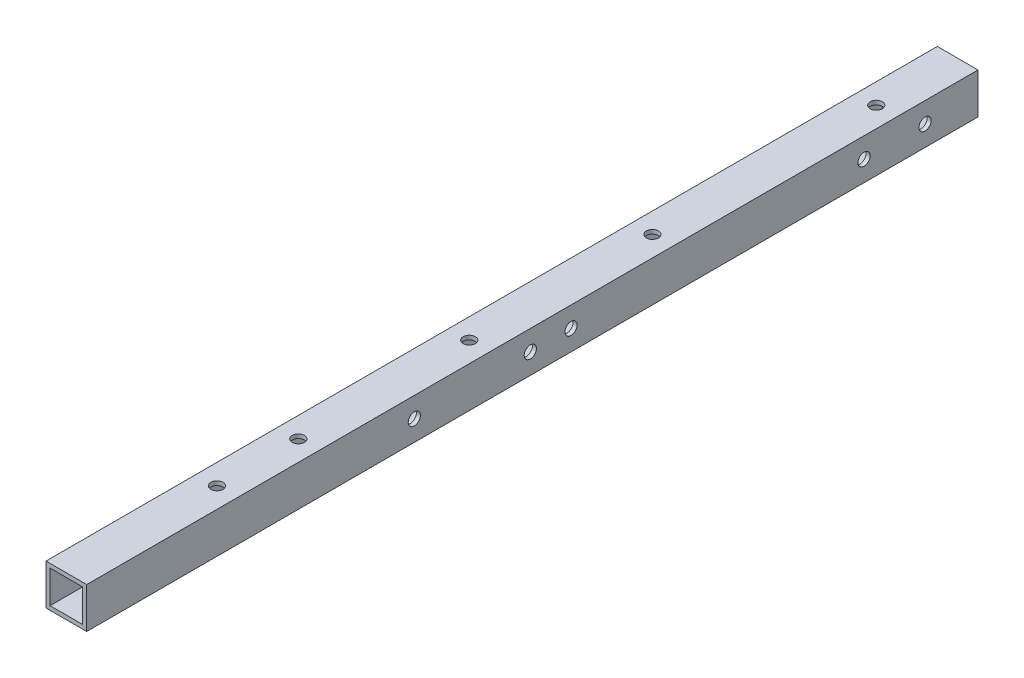
ISO-10303-21;
HEADER;
FILE_DESCRIPTION(('STEP AP214'),'2;1');
FILE_NAME('part.step','',(''),(''),'','','');
FILE_SCHEMA(('AUTOMOTIVE_DESIGN { 1 0 10303 214 1 1 1 1 }'));
ENDSEC;
DATA;
#1=APPLICATION_CONTEXT('core data for automotive mechanical design processes');
#2=APPLICATION_PROTOCOL_DEFINITION('international standard','automotive_design',2000,#1);
#3=PRODUCT_CONTEXT('',#1,'mechanical');
#4=PRODUCT('Part','Part','',(#3));
#5=PRODUCT_RELATED_PRODUCT_CATEGORY('part','',(#4));
#6=PRODUCT_DEFINITION_FORMATION('','',#4);
#7=PRODUCT_DEFINITION_CONTEXT('part definition',#1,'design');
#8=PRODUCT_DEFINITION('design','',#6,#7);
#9=PRODUCT_DEFINITION_SHAPE('','',#8);
#10=(LENGTH_UNIT() NAMED_UNIT(*) SI_UNIT(.MILLI.,.METRE.));
#11=(NAMED_UNIT(*) PLANE_ANGLE_UNIT() SI_UNIT($,.RADIAN.));
#12=(NAMED_UNIT(*) SI_UNIT($,.STERADIAN.) SOLID_ANGLE_UNIT());
#13=UNCERTAINTY_MEASURE_WITH_UNIT(LENGTH_MEASURE(1.E-05),#10,'distance_accuracy_value','');
#14=(GEOMETRIC_REPRESENTATION_CONTEXT(3) GLOBAL_UNCERTAINTY_ASSIGNED_CONTEXT((#13)) GLOBAL_UNIT_ASSIGNED_CONTEXT((#10,
#11,#12)) REPRESENTATION_CONTEXT('',''));
#15=CARTESIAN_POINT('',(0.,0.,0.));
#16=DIRECTION('',(0.,0.,1.));
#17=DIRECTION('',(1.,0.,0.));
#18=AXIS2_PLACEMENT_3D('',#15,#16,#17);
#19=CARTESIAN_POINT('',(0.,0.,219.));
#20=DIRECTION('',(0.,0.,1.));
#21=DIRECTION('',(1.,0.,0.));
#22=AXIS2_PLACEMENT_3D('',#19,#20,#21);
#23=PLANE('',#22);
#24=DIRECTION('',(0.,-1.,0.));
#25=VECTOR('',#24,1.);
#26=CARTESIAN_POINT('',(-5.,-5.,219.));
#27=LINE('',#26,#25);
#28=CARTESIAN_POINT('',(-5.,5.,219.));
#29=VERTEX_POINT('',#28);
#30=CARTESIAN_POINT('',(-5.,-5.,219.));
#31=VERTEX_POINT('',#30);
#32=EDGE_CURVE('E168',#29,#31,#27,.T.);
#33=ORIENTED_EDGE('',*,*,#32,.T.);
#34=DIRECTION('',(1.,0.,0.));
#35=VECTOR('',#34,1.);
#36=CARTESIAN_POINT('',(-5.,-5.,219.));
#37=LINE('',#36,#35);
#38=CARTESIAN_POINT('',(5.,-5.,219.));
#39=VERTEX_POINT('',#38);
#40=EDGE_CURVE('E171',#31,#39,#37,.T.);
#41=ORIENTED_EDGE('',*,*,#40,.T.);
#42=DIRECTION('',(0.,1.,0.));
#43=VECTOR('',#42,1.);
#44=CARTESIAN_POINT('',(5.,-5.,219.));
#45=LINE('',#44,#43);
#46=CARTESIAN_POINT('',(5.,5.,219.));
#47=VERTEX_POINT('',#46);
#48=EDGE_CURVE('E174',#39,#47,#45,.T.);
#49=ORIENTED_EDGE('',*,*,#48,.T.);
#50=DIRECTION('',(-1.,0.,0.));
#51=VECTOR('',#50,1.);
#52=CARTESIAN_POINT('',(-5.,5.,219.));
#53=LINE('',#52,#51);
#54=EDGE_CURVE('E176',#47,#29,#53,.T.);
#55=ORIENTED_EDGE('',*,*,#54,.T.);
#56=EDGE_LOOP('',(#33,#41,#49,#55));
#57=FACE_BOUND('',#56,.T.);
#58=DIRECTION('',(1.,0.,0.));
#59=VECTOR('',#58,1.);
#60=CARTESIAN_POINT('',(0.,-4.,219.));
#61=LINE('',#60,#59);
#62=CARTESIAN_POINT('',(-4.,-4.,219.));
#63=VERTEX_POINT('',#62);
#64=CARTESIAN_POINT('',(4.,-4.,219.));
#65=VERTEX_POINT('',#64);
#66=EDGE_CURVE('E138',#63,#65,#61,.T.);
#67=ORIENTED_EDGE('',*,*,#66,.F.);
#68=DIRECTION('',(0.,-1.,0.));
#69=VECTOR('',#68,1.);
#70=CARTESIAN_POINT('',(-4.,0.,219.));
#71=LINE('',#70,#69);
#72=CARTESIAN_POINT('',(-4.,4.,219.));
#73=VERTEX_POINT('',#72);
#74=EDGE_CURVE('E130',#73,#63,#71,.T.);
#75=ORIENTED_EDGE('',*,*,#74,.F.);
#76=DIRECTION('',(-1.,0.,0.));
#77=VECTOR('',#76,1.);
#78=CARTESIAN_POINT('',(0.,4.,219.));
#79=LINE('',#78,#77);
#80=CARTESIAN_POINT('',(4.,4.,219.));
#81=VERTEX_POINT('',#80);
#82=EDGE_CURVE('E152',#81,#73,#79,.T.);
#83=ORIENTED_EDGE('',*,*,#82,.F.);
#84=DIRECTION('',(0.,1.,0.));
#85=VECTOR('',#84,1.);
#86=CARTESIAN_POINT('',(4.,0.,219.));
#87=LINE('',#86,#85);
#88=EDGE_CURVE('E150',#65,#81,#87,.T.);
#89=ORIENTED_EDGE('',*,*,#88,.F.);
#90=EDGE_LOOP('',(#67,#75,#83,#89));
#91=FACE_BOUND('',#90,.T.);
#92=ADVANCED_FACE('F63',(#57,#91),#23,.T.);
#93=CARTESIAN_POINT('',(0.,0.,0.));
#94=DIRECTION('',(0.,0.,1.));
#95=DIRECTION('',(1.,0.,0.));
#96=AXIS2_PLACEMENT_3D('',#93,#94,#95);
#97=PLANE('',#96);
#98=DIRECTION('',(0.,-1.,0.));
#99=VECTOR('',#98,1.);
#100=CARTESIAN_POINT('',(-5.,-5.,0.));
#101=LINE('',#100,#99);
#102=CARTESIAN_POINT('',(-5.,5.,0.));
#103=VERTEX_POINT('',#102);
#104=CARTESIAN_POINT('',(-5.,-5.,0.));
#105=VERTEX_POINT('',#104);
#106=EDGE_CURVE('E146',#103,#105,#101,.T.);
#107=ORIENTED_EDGE('',*,*,#106,.F.);
#108=DIRECTION('',(-1.,0.,0.));
#109=VECTOR('',#108,1.);
#110=CARTESIAN_POINT('',(-5.,5.,0.));
#111=LINE('',#110,#109);
#112=CARTESIAN_POINT('',(5.,5.,0.));
#113=VERTEX_POINT('',#112);
#114=EDGE_CURVE('E172',#113,#103,#111,.T.);
#115=ORIENTED_EDGE('',*,*,#114,.F.);
#116=DIRECTION('',(0.,1.,0.));
#117=VECTOR('',#116,1.);
#118=CARTESIAN_POINT('',(5.,-5.,0.));
#119=LINE('',#118,#117);
#120=CARTESIAN_POINT('',(5.,-5.,0.));
#121=VERTEX_POINT('',#120);
#122=EDGE_CURVE('E183',#121,#113,#119,.T.);
#123=ORIENTED_EDGE('',*,*,#122,.F.);
#124=DIRECTION('',(1.,0.,0.));
#125=VECTOR('',#124,1.);
#126=CARTESIAN_POINT('',(-5.,-5.,0.));
#127=LINE('',#126,#125);
#128=EDGE_CURVE('E181',#105,#121,#127,.T.);
#129=ORIENTED_EDGE('',*,*,#128,.F.);
#130=EDGE_LOOP('',(#107,#115,#123,#129));
#131=FACE_BOUND('',#130,.T.);
#132=DIRECTION('',(0.,-1.,0.));
#133=VECTOR('',#132,1.);
#134=CARTESIAN_POINT('',(-4.,0.,0.));
#135=LINE('',#134,#133);
#136=CARTESIAN_POINT('',(-4.,4.,0.));
#137=VERTEX_POINT('',#136);
#138=CARTESIAN_POINT('',(-4.,-4.,0.));
#139=VERTEX_POINT('',#138);
#140=EDGE_CURVE('E88',#137,#139,#135,.T.);
#141=ORIENTED_EDGE('',*,*,#140,.T.);
#142=DIRECTION('',(1.,0.,0.));
#143=VECTOR('',#142,1.);
#144=CARTESIAN_POINT('',(0.,-4.,0.));
#145=LINE('',#144,#143);
#146=CARTESIAN_POINT('',(4.,-4.,0.));
#147=VERTEX_POINT('',#146);
#148=EDGE_CURVE('E145',#139,#147,#145,.T.);
#149=ORIENTED_EDGE('',*,*,#148,.T.);
#150=DIRECTION('',(0.,1.,0.));
#151=VECTOR('',#150,1.);
#152=CARTESIAN_POINT('',(4.,0.,0.));
#153=LINE('',#152,#151);
#154=CARTESIAN_POINT('',(4.,4.,0.));
#155=VERTEX_POINT('',#154);
#156=EDGE_CURVE('E160',#147,#155,#153,.T.);
#157=ORIENTED_EDGE('',*,*,#156,.T.);
#158=DIRECTION('',(-1.,0.,0.));
#159=VECTOR('',#158,1.);
#160=CARTESIAN_POINT('',(0.,4.,0.));
#161=LINE('',#160,#159);
#162=EDGE_CURVE('E139',#155,#137,#161,.T.);
#163=ORIENTED_EDGE('',*,*,#162,.T.);
#164=EDGE_LOOP('',(#141,#149,#157,#163));
#165=FACE_BOUND('',#164,.T.);
#166=ADVANCED_FACE('F319',(#131,#165),#97,.F.);
#167=CARTESIAN_POINT('',(-5.,-5.,219.));
#168=DIRECTION('',(1.,0.,0.));
#169=DIRECTION('',(0.,0.,-1.));
#170=AXIS2_PLACEMENT_3D('',#167,#168,#169);
#171=PLANE('',#170);
#172=CARTESIAN_POINT('',(-5.,0.,13.));
#173=DIRECTION('',(1.,0.,0.));
#174=DIRECTION('',(0.,0.,-1.));
#175=AXIS2_PLACEMENT_3D('',#172,#173,#174);
#176=CIRCLE('',#175,1.5);
#177=CARTESIAN_POINT('',(-5.,0.,11.5));
#178=VERTEX_POINT('',#177);
#179=EDGE_CURVE('E217',#178,#178,#176,.T.);
#180=ORIENTED_EDGE('',*,*,#179,.T.);
#181=EDGE_LOOP('',(#180));
#182=FACE_BOUND('',#181,.T.);
#183=CARTESIAN_POINT('',(-5.,0.,28.));
#184=DIRECTION('',(1.,0.,0.));
#185=DIRECTION('',(0.,0.,-1.));
#186=AXIS2_PLACEMENT_3D('',#183,#184,#185);
#187=CIRCLE('',#186,1.5);
#188=CARTESIAN_POINT('',(-5.,0.,26.5));
#189=VERTEX_POINT('',#188);
#190=EDGE_CURVE('E720',#189,#189,#187,.T.);
#191=ORIENTED_EDGE('',*,*,#190,.T.);
#192=EDGE_LOOP('',(#191));
#193=FACE_BOUND('',#192,.T.);
#194=CARTESIAN_POINT('',(-5.,0.,100.));
#195=DIRECTION('',(1.,0.,0.));
#196=DIRECTION('',(0.,0.,-1.));
#197=AXIS2_PLACEMENT_3D('',#194,#195,#196);
#198=CIRCLE('',#197,1.5);
#199=CARTESIAN_POINT('',(-5.,0.,98.5));
#200=VERTEX_POINT('',#199);
#201=EDGE_CURVE('E724',#200,#200,#198,.T.);
#202=ORIENTED_EDGE('',*,*,#201,.T.);
#203=EDGE_LOOP('',(#202));
#204=FACE_BOUND('',#203,.T.);
#205=CARTESIAN_POINT('',(-5.,0.,138.5));
#206=DIRECTION('',(1.,0.,0.));
#207=DIRECTION('',(0.,0.,-1.));
#208=AXIS2_PLACEMENT_3D('',#205,#206,#207);
#209=CIRCLE('',#208,1.5);
#210=CARTESIAN_POINT('',(-5.,0.,137.));
#211=VERTEX_POINT('',#210);
#212=EDGE_CURVE('E363',#211,#211,#209,.T.);
#213=ORIENTED_EDGE('',*,*,#212,.T.);
#214=EDGE_LOOP('',(#213));
#215=FACE_BOUND('',#214,.T.);
#216=CARTESIAN_POINT('',(-5.,0.,110.));
#217=DIRECTION('',(1.,0.,0.));
#218=DIRECTION('',(0.,0.,-1.));
#219=AXIS2_PLACEMENT_3D('',#216,#217,#218);
#220=CIRCLE('',#219,1.5);
#221=CARTESIAN_POINT('',(-5.,0.,108.5));
#222=VERTEX_POINT('',#221);
#223=EDGE_CURVE('E364',#222,#222,#220,.T.);
#224=ORIENTED_EDGE('',*,*,#223,.T.);
#225=EDGE_LOOP('',(#224));
#226=FACE_BOUND('',#225,.T.);
#227=ORIENTED_EDGE('',*,*,#106,.T.);
#228=DIRECTION('',(0.,0.,-1.));
#229=VECTOR('',#228,1.);
#230=CARTESIAN_POINT('',(-5.,-5.,219.));
#231=LINE('',#230,#229);
#232=EDGE_CURVE('E12',#31,#105,#231,.T.);
#233=ORIENTED_EDGE('',*,*,#232,.F.);
#234=ORIENTED_EDGE('',*,*,#32,.F.);
#235=DIRECTION('',(0.,0.,-1.));
#236=VECTOR('',#235,1.);
#237=CARTESIAN_POINT('',(-5.,5.,219.));
#238=LINE('',#237,#236);
#239=EDGE_CURVE('E178',#29,#103,#238,.T.);
#240=ORIENTED_EDGE('',*,*,#239,.T.);
#241=EDGE_LOOP('',(#227,#233,#234,#240));
#242=FACE_BOUND('',#241,.T.);
#243=ADVANCED_FACE('F65',(#182,#193,#204,#215,#226,#242),#171,.F.);
#244=CARTESIAN_POINT('',(-5.,-5.,219.));
#245=DIRECTION('',(0.,1.,0.));
#246=DIRECTION('',(-1.,0.,0.));
#247=AXIS2_PLACEMENT_3D('',#244,#245,#246);
#248=PLANE('',#247);
#249=CARTESIAN_POINT('',(0.,-5.,182.));
#250=DIRECTION('',(0.,1.,0.));
#251=DIRECTION('',(0.,0.,1.));
#252=AXIS2_PLACEMENT_3D('',#249,#250,#251);
#253=CIRCLE('',#252,1.5);
#254=CARTESIAN_POINT('',(0.,-5.,183.5));
#255=VERTEX_POINT('',#254);
#256=EDGE_CURVE('E197',#255,#255,#253,.T.);
#257=ORIENTED_EDGE('',*,*,#256,.T.);
#258=EDGE_LOOP('',(#257));
#259=FACE_BOUND('',#258,.T.);
#260=CARTESIAN_POINT('',(0.,-5.,75.));
#261=DIRECTION('',(0.,1.,0.));
#262=DIRECTION('',(0.,0.,1.));
#263=AXIS2_PLACEMENT_3D('',#260,#261,#262);
#264=CIRCLE('',#263,1.5);
#265=CARTESIAN_POINT('',(0.,-5.,76.5));
#266=VERTEX_POINT('',#265);
#267=EDGE_CURVE('E242',#266,#266,#264,.T.);
#268=ORIENTED_EDGE('',*,*,#267,.T.);
#269=EDGE_LOOP('',(#268));
#270=FACE_BOUND('',#269,.T.);
#271=CARTESIAN_POINT('',(0.,-5.,162.));
#272=DIRECTION('',(0.,1.,0.));
#273=DIRECTION('',(0.,0.,1.));
#274=AXIS2_PLACEMENT_3D('',#271,#272,#273);
#275=CIRCLE('',#274,1.5);
#276=CARTESIAN_POINT('',(0.,-5.,163.5));
#277=VERTEX_POINT('',#276);
#278=EDGE_CURVE('E253',#277,#277,#275,.T.);
#279=ORIENTED_EDGE('',*,*,#278,.T.);
#280=EDGE_LOOP('',(#279));
#281=FACE_BOUND('',#280,.T.);
#282=CARTESIAN_POINT('',(0.,-5.,120.));
#283=DIRECTION('',(0.,1.,0.));
#284=DIRECTION('',(0.,0.,1.));
#285=AXIS2_PLACEMENT_3D('',#282,#283,#284);
#286=CIRCLE('',#285,1.5);
#287=CARTESIAN_POINT('',(0.,-5.,121.5));
#288=VERTEX_POINT('',#287);
#289=EDGE_CURVE('E252',#288,#288,#286,.T.);
#290=ORIENTED_EDGE('',*,*,#289,.T.);
#291=EDGE_LOOP('',(#290));
#292=FACE_BOUND('',#291,.T.);
#293=CARTESIAN_POINT('',(0.,-5.,20.));
#294=DIRECTION('',(0.,1.,0.));
#295=DIRECTION('',(0.,0.,1.));
#296=AXIS2_PLACEMENT_3D('',#293,#294,#295);
#297=CIRCLE('',#296,1.5);
#298=CARTESIAN_POINT('',(0.,-5.,21.5));
#299=VERTEX_POINT('',#298);
#300=EDGE_CURVE('E263',#299,#299,#297,.T.);
#301=ORIENTED_EDGE('',*,*,#300,.T.);
#302=EDGE_LOOP('',(#301));
#303=FACE_BOUND('',#302,.T.);
#304=ORIENTED_EDGE('',*,*,#128,.T.);
#305=DIRECTION('',(0.,0.,-1.));
#306=VECTOR('',#305,1.);
#307=CARTESIAN_POINT('',(5.,-5.,219.));
#308=LINE('',#307,#306);
#309=EDGE_CURVE('E72',#39,#121,#308,.T.);
#310=ORIENTED_EDGE('',*,*,#309,.F.);
#311=ORIENTED_EDGE('',*,*,#40,.F.);
#312=ORIENTED_EDGE('',*,*,#232,.T.);
#313=EDGE_LOOP('',(#304,#310,#311,#312));
#314=FACE_BOUND('',#313,.T.);
#315=ADVANCED_FACE('F305',(#259,#270,#281,#292,#303,#314),#248,.F.);
#316=CARTESIAN_POINT('',(5.,-5.,219.));
#317=DIRECTION('',(-1.,0.,0.));
#318=DIRECTION('',(0.,0.,1.));
#319=AXIS2_PLACEMENT_3D('',#316,#317,#318);
#320=PLANE('',#319);
#321=CARTESIAN_POINT('',(5.,0.,13.));
#322=DIRECTION('',(1.,0.,0.));
#323=DIRECTION('',(0.,0.,-1.));
#324=AXIS2_PLACEMENT_3D('',#321,#322,#323);
#325=CIRCLE('',#324,1.5);
#326=CARTESIAN_POINT('',(5.,0.,11.5));
#327=VERTEX_POINT('',#326);
#328=EDGE_CURVE('E346',#327,#327,#325,.T.);
#329=ORIENTED_EDGE('',*,*,#328,.F.);
#330=EDGE_LOOP('',(#329));
#331=FACE_BOUND('',#330,.T.);
#332=CARTESIAN_POINT('',(5.,0.,28.));
#333=DIRECTION('',(1.,0.,0.));
#334=DIRECTION('',(0.,0.,-1.));
#335=AXIS2_PLACEMENT_3D('',#332,#333,#334);
#336=CIRCLE('',#335,1.5);
#337=CARTESIAN_POINT('',(5.,0.,26.5));
#338=VERTEX_POINT('',#337);
#339=EDGE_CURVE('E350',#338,#338,#336,.T.);
#340=ORIENTED_EDGE('',*,*,#339,.F.);
#341=EDGE_LOOP('',(#340));
#342=FACE_BOUND('',#341,.T.);
#343=CARTESIAN_POINT('',(5.,0.,100.));
#344=DIRECTION('',(1.,0.,0.));
#345=DIRECTION('',(0.,0.,-1.));
#346=AXIS2_PLACEMENT_3D('',#343,#344,#345);
#347=CIRCLE('',#346,1.5);
#348=CARTESIAN_POINT('',(5.,0.,98.5));
#349=VERTEX_POINT('',#348);
#350=EDGE_CURVE('E354',#349,#349,#347,.T.);
#351=ORIENTED_EDGE('',*,*,#350,.F.);
#352=EDGE_LOOP('',(#351));
#353=FACE_BOUND('',#352,.T.);
#354=CARTESIAN_POINT('',(5.,0.,138.5));
#355=DIRECTION('',(1.,0.,0.));
#356=DIRECTION('',(0.,0.,-1.));
#357=AXIS2_PLACEMENT_3D('',#354,#355,#356);
#358=CIRCLE('',#357,1.5);
#359=CARTESIAN_POINT('',(5.,0.,137.));
#360=VERTEX_POINT('',#359);
#361=EDGE_CURVE('E358',#360,#360,#358,.T.);
#362=ORIENTED_EDGE('',*,*,#361,.F.);
#363=EDGE_LOOP('',(#362));
#364=FACE_BOUND('',#363,.T.);
#365=CARTESIAN_POINT('',(5.,0.,110.));
#366=DIRECTION('',(1.,0.,0.));
#367=DIRECTION('',(0.,0.,-1.));
#368=AXIS2_PLACEMENT_3D('',#365,#366,#367);
#369=CIRCLE('',#368,1.5);
#370=CARTESIAN_POINT('',(5.,0.,108.5));
#371=VERTEX_POINT('',#370);
#372=EDGE_CURVE('E361',#371,#371,#369,.T.);
#373=ORIENTED_EDGE('',*,*,#372,.F.);
#374=EDGE_LOOP('',(#373));
#375=FACE_BOUND('',#374,.T.);
#376=ORIENTED_EDGE('',*,*,#122,.T.);
#377=DIRECTION('',(0.,0.,-1.));
#378=VECTOR('',#377,1.);
#379=CARTESIAN_POINT('',(5.,5.,219.));
#380=LINE('',#379,#378);
#381=EDGE_CURVE('E188',#47,#113,#380,.T.);
#382=ORIENTED_EDGE('',*,*,#381,.F.);
#383=ORIENTED_EDGE('',*,*,#48,.F.);
#384=ORIENTED_EDGE('',*,*,#309,.T.);
#385=EDGE_LOOP('',(#376,#382,#383,#384));
#386=FACE_BOUND('',#385,.T.);
#387=ADVANCED_FACE('F308',(#331,#342,#353,#364,#375,#386),#320,.F.);
#388=CARTESIAN_POINT('',(-5.,5.,219.));
#389=DIRECTION('',(0.,-1.,0.));
#390=DIRECTION('',(0.,0.,-1.));
#391=AXIS2_PLACEMENT_3D('',#388,#389,#390);
#392=PLANE('',#391);
#393=CARTESIAN_POINT('',(0.,5.,182.));
#394=DIRECTION('',(0.,1.,0.));
#395=DIRECTION('',(0.,0.,1.));
#396=AXIS2_PLACEMENT_3D('',#393,#394,#395);
#397=CIRCLE('',#396,1.5);
#398=CARTESIAN_POINT('',(0.,5.,183.5));
#399=VERTEX_POINT('',#398);
#400=EDGE_CURVE('E245',#399,#399,#397,.T.);
#401=ORIENTED_EDGE('',*,*,#400,.F.);
#402=EDGE_LOOP('',(#401));
#403=FACE_BOUND('',#402,.T.);
#404=CARTESIAN_POINT('',(0.,5.,75.));
#405=DIRECTION('',(0.,1.,0.));
#406=DIRECTION('',(0.,0.,1.));
#407=AXIS2_PLACEMENT_3D('',#404,#405,#406);
#408=CIRCLE('',#407,1.5);
#409=CARTESIAN_POINT('',(0.,5.,76.5));
#410=VERTEX_POINT('',#409);
#411=EDGE_CURVE('E256',#410,#410,#408,.T.);
#412=ORIENTED_EDGE('',*,*,#411,.F.);
#413=EDGE_LOOP('',(#412));
#414=FACE_BOUND('',#413,.T.);
#415=CARTESIAN_POINT('',(0.,5.,162.));
#416=DIRECTION('',(0.,1.,0.));
#417=DIRECTION('',(0.,0.,1.));
#418=AXIS2_PLACEMENT_3D('',#415,#416,#417);
#419=CIRCLE('',#418,1.5);
#420=CARTESIAN_POINT('',(0.,5.,163.5));
#421=VERTEX_POINT('',#420);
#422=EDGE_CURVE('E249',#421,#421,#419,.T.);
#423=ORIENTED_EDGE('',*,*,#422,.F.);
#424=EDGE_LOOP('',(#423));
#425=FACE_BOUND('',#424,.T.);
#426=CARTESIAN_POINT('',(0.,5.,120.));
#427=DIRECTION('',(0.,1.,0.));
#428=DIRECTION('',(0.,0.,1.));
#429=AXIS2_PLACEMENT_3D('',#426,#427,#428);
#430=CIRCLE('',#429,1.5);
#431=CARTESIAN_POINT('',(0.,5.,121.5));
#432=VERTEX_POINT('',#431);
#433=EDGE_CURVE('E266',#432,#432,#430,.T.);
#434=ORIENTED_EDGE('',*,*,#433,.F.);
#435=EDGE_LOOP('',(#434));
#436=FACE_BOUND('',#435,.T.);
#437=CARTESIAN_POINT('',(0.,5.,20.));
#438=DIRECTION('',(0.,1.,0.));
#439=DIRECTION('',(0.,0.,1.));
#440=AXIS2_PLACEMENT_3D('',#437,#438,#439);
#441=CIRCLE('',#440,1.5);
#442=CARTESIAN_POINT('',(0.,5.,21.5));
#443=VERTEX_POINT('',#442);
#444=EDGE_CURVE('E248',#443,#443,#441,.T.);
#445=ORIENTED_EDGE('',*,*,#444,.F.);
#446=EDGE_LOOP('',(#445));
#447=FACE_BOUND('',#446,.T.);
#448=ORIENTED_EDGE('',*,*,#114,.T.);
#449=ORIENTED_EDGE('',*,*,#239,.F.);
#450=ORIENTED_EDGE('',*,*,#54,.F.);
#451=ORIENTED_EDGE('',*,*,#381,.T.);
#452=EDGE_LOOP('',(#448,#449,#450,#451));
#453=FACE_BOUND('',#452,.T.);
#454=ADVANCED_FACE('F323',(#403,#414,#425,#436,#447,#453),#392,.F.);
#455=CARTESIAN_POINT('',(-4.,0.,219.));
#456=DIRECTION('',(1.,0.,0.));
#457=DIRECTION('',(0.,0.,-1.));
#458=AXIS2_PLACEMENT_3D('',#455,#456,#457);
#459=PLANE('',#458);
#460=CARTESIAN_POINT('',(-4.,0.,13.));
#461=DIRECTION('',(1.,0.,0.));
#462=DIRECTION('',(0.,0.,-1.));
#463=AXIS2_PLACEMENT_3D('',#460,#461,#462);
#464=CIRCLE('',#463,1.5);
#465=CARTESIAN_POINT('',(-4.,0.,11.5));
#466=VERTEX_POINT('',#465);
#467=EDGE_CURVE('E239',#466,#466,#464,.T.);
#468=ORIENTED_EDGE('',*,*,#467,.F.);
#469=EDGE_LOOP('',(#468));
#470=FACE_BOUND('',#469,.T.);
#471=CARTESIAN_POINT('',(-4.,0.,28.));
#472=DIRECTION('',(1.,0.,0.));
#473=DIRECTION('',(0.,0.,-1.));
#474=AXIS2_PLACEMENT_3D('',#471,#472,#473);
#475=CIRCLE('',#474,1.5);
#476=CARTESIAN_POINT('',(-4.,0.,26.5));
#477=VERTEX_POINT('',#476);
#478=EDGE_CURVE('E227',#477,#477,#475,.T.);
#479=ORIENTED_EDGE('',*,*,#478,.F.);
#480=EDGE_LOOP('',(#479));
#481=FACE_BOUND('',#480,.T.);
#482=CARTESIAN_POINT('',(-4.,0.,100.));
#483=DIRECTION('',(1.,0.,0.));
#484=DIRECTION('',(0.,0.,-1.));
#485=AXIS2_PLACEMENT_3D('',#482,#483,#484);
#486=CIRCLE('',#485,1.5);
#487=CARTESIAN_POINT('',(-4.,0.,98.5));
#488=VERTEX_POINT('',#487);
#489=EDGE_CURVE('E224',#488,#488,#486,.T.);
#490=ORIENTED_EDGE('',*,*,#489,.F.);
#491=EDGE_LOOP('',(#490));
#492=FACE_BOUND('',#491,.T.);
#493=CARTESIAN_POINT('',(-4.,0.,138.5));
#494=DIRECTION('',(1.,0.,0.));
#495=DIRECTION('',(0.,0.,-1.));
#496=AXIS2_PLACEMENT_3D('',#493,#494,#495);
#497=CIRCLE('',#496,1.5);
#498=CARTESIAN_POINT('',(-4.,0.,137.));
#499=VERTEX_POINT('',#498);
#500=EDGE_CURVE('E221',#499,#499,#497,.T.);
#501=ORIENTED_EDGE('',*,*,#500,.F.);
#502=EDGE_LOOP('',(#501));
#503=FACE_BOUND('',#502,.T.);
#504=CARTESIAN_POINT('',(-4.,0.,110.));
#505=DIRECTION('',(1.,0.,0.));
#506=DIRECTION('',(0.,0.,-1.));
#507=AXIS2_PLACEMENT_3D('',#504,#505,#506);
#508=CIRCLE('',#507,1.5);
#509=CARTESIAN_POINT('',(-4.,0.,108.5));
#510=VERTEX_POINT('',#509);
#511=EDGE_CURVE('E216',#510,#510,#508,.T.);
#512=ORIENTED_EDGE('',*,*,#511,.F.);
#513=EDGE_LOOP('',(#512));
#514=FACE_BOUND('',#513,.T.);
#515=ORIENTED_EDGE('',*,*,#140,.F.);
#516=DIRECTION('',(0.,0.,-1.));
#517=VECTOR('',#516,1.);
#518=CARTESIAN_POINT('',(-4.,4.,219.));
#519=LINE('',#518,#517);
#520=EDGE_CURVE('E134',#73,#137,#519,.T.);
#521=ORIENTED_EDGE('',*,*,#520,.F.);
#522=ORIENTED_EDGE('',*,*,#74,.T.);
#523=DIRECTION('',(0.,0.,-1.));
#524=VECTOR('',#523,1.);
#525=CARTESIAN_POINT('',(-4.,-4.,219.));
#526=LINE('',#525,#524);
#527=EDGE_CURVE('E133',#63,#139,#526,.T.);
#528=ORIENTED_EDGE('',*,*,#527,.T.);
#529=EDGE_LOOP('',(#515,#521,#522,#528));
#530=FACE_BOUND('',#529,.T.);
#531=ADVANCED_FACE('F132',(#470,#481,#492,#503,#514,#530),#459,.T.);
#532=CARTESIAN_POINT('',(0.,-4.,219.));
#533=DIRECTION('',(0.,1.,0.));
#534=DIRECTION('',(-1.,0.,0.));
#535=AXIS2_PLACEMENT_3D('',#532,#533,#534);
#536=PLANE('',#535);
#537=CARTESIAN_POINT('',(0.,-4.,182.));
#538=DIRECTION('',(0.,1.,0.));
#539=DIRECTION('',(-1.,0.,0.));
#540=AXIS2_PLACEMENT_3D('',#537,#538,#539);
#541=CIRCLE('',#540,1.5);
#542=CARTESIAN_POINT('',(-1.5,-4.,182.));
#543=VERTEX_POINT('',#542);
#544=EDGE_CURVE('E158',#543,#543,#541,.T.);
#545=ORIENTED_EDGE('',*,*,#544,.F.);
#546=EDGE_LOOP('',(#545));
#547=FACE_BOUND('',#546,.T.);
#548=CARTESIAN_POINT('',(0.,-4.,75.));
#549=DIRECTION('',(0.,1.,0.));
#550=DIRECTION('',(-1.,0.,0.));
#551=AXIS2_PLACEMENT_3D('',#548,#549,#550);
#552=CIRCLE('',#551,1.5);
#553=CARTESIAN_POINT('',(-1.5,-4.,75.));
#554=VERTEX_POINT('',#553);
#555=EDGE_CURVE('E209',#554,#554,#552,.T.);
#556=ORIENTED_EDGE('',*,*,#555,.F.);
#557=EDGE_LOOP('',(#556));
#558=FACE_BOUND('',#557,.T.);
#559=CARTESIAN_POINT('',(0.,-4.,162.));
#560=DIRECTION('',(0.,1.,0.));
#561=DIRECTION('',(-1.,0.,0.));
#562=AXIS2_PLACEMENT_3D('',#559,#560,#561);
#563=CIRCLE('',#562,1.5);
#564=CARTESIAN_POINT('',(-1.5,-4.,162.));
#565=VERTEX_POINT('',#564);
#566=EDGE_CURVE('E205',#565,#565,#563,.T.);
#567=ORIENTED_EDGE('',*,*,#566,.F.);
#568=EDGE_LOOP('',(#567));
#569=FACE_BOUND('',#568,.T.);
#570=CARTESIAN_POINT('',(0.,-4.,120.));
#571=DIRECTION('',(0.,1.,0.));
#572=DIRECTION('',(-1.,0.,0.));
#573=AXIS2_PLACEMENT_3D('',#570,#571,#572);
#574=CIRCLE('',#573,1.5);
#575=CARTESIAN_POINT('',(-1.5,-4.,120.));
#576=VERTEX_POINT('',#575);
#577=EDGE_CURVE('E201',#576,#576,#574,.T.);
#578=ORIENTED_EDGE('',*,*,#577,.F.);
#579=EDGE_LOOP('',(#578));
#580=FACE_BOUND('',#579,.T.);
#581=CARTESIAN_POINT('',(0.,-4.,20.));
#582=DIRECTION('',(0.,1.,0.));
#583=DIRECTION('',(-1.,0.,0.));
#584=AXIS2_PLACEMENT_3D('',#581,#582,#583);
#585=CIRCLE('',#584,1.5);
#586=CARTESIAN_POINT('',(-1.5,-4.,20.));
#587=VERTEX_POINT('',#586);
#588=EDGE_CURVE('E196',#587,#587,#585,.T.);
#589=ORIENTED_EDGE('',*,*,#588,.F.);
#590=EDGE_LOOP('',(#589));
#591=FACE_BOUND('',#590,.T.);
#592=ORIENTED_EDGE('',*,*,#148,.F.);
#593=ORIENTED_EDGE('',*,*,#527,.F.);
#594=ORIENTED_EDGE('',*,*,#66,.T.);
#595=DIRECTION('',(0.,0.,-1.));
#596=VECTOR('',#595,1.);
#597=CARTESIAN_POINT('',(4.,-4.,219.));
#598=LINE('',#597,#596);
#599=EDGE_CURVE('E147',#65,#147,#598,.T.);
#600=ORIENTED_EDGE('',*,*,#599,.T.);
#601=EDGE_LOOP('',(#592,#593,#594,#600));
#602=FACE_BOUND('',#601,.T.);
#603=ADVANCED_FACE('F142',(#547,#558,#569,#580,#591,#602),#536,.T.);
#604=CARTESIAN_POINT('',(4.,0.,219.));
#605=DIRECTION('',(-1.,0.,0.));
#606=DIRECTION('',(0.,0.,1.));
#607=AXIS2_PLACEMENT_3D('',#604,#605,#606);
#608=PLANE('',#607);
#609=CARTESIAN_POINT('',(4.,0.,13.));
#610=DIRECTION('',(-1.,0.,0.));
#611=DIRECTION('',(0.,0.,1.));
#612=AXIS2_PLACEMENT_3D('',#609,#610,#611);
#613=CIRCLE('',#612,1.5);
#614=CARTESIAN_POINT('',(4.,0.,14.5));
#615=VERTEX_POINT('',#614);
#616=EDGE_CURVE('E67',#615,#615,#613,.T.);
#617=ORIENTED_EDGE('',*,*,#616,.F.);
#618=EDGE_LOOP('',(#617));
#619=FACE_BOUND('',#618,.T.);
#620=CARTESIAN_POINT('',(4.,0.,28.));
#621=DIRECTION('',(-1.,0.,0.));
#622=DIRECTION('',(0.,0.,1.));
#623=AXIS2_PLACEMENT_3D('',#620,#621,#622);
#624=CIRCLE('',#623,1.5);
#625=CARTESIAN_POINT('',(4.,0.,29.5));
#626=VERTEX_POINT('',#625);
#627=EDGE_CURVE('E225',#626,#626,#624,.T.);
#628=ORIENTED_EDGE('',*,*,#627,.F.);
#629=EDGE_LOOP('',(#628));
#630=FACE_BOUND('',#629,.T.);
#631=CARTESIAN_POINT('',(4.,0.,100.));
#632=DIRECTION('',(-1.,0.,0.));
#633=DIRECTION('',(0.,0.,1.));
#634=AXIS2_PLACEMENT_3D('',#631,#632,#633);
#635=CIRCLE('',#634,1.5);
#636=CARTESIAN_POINT('',(4.,0.,101.5));
#637=VERTEX_POINT('',#636);
#638=EDGE_CURVE('E222',#637,#637,#635,.T.);
#639=ORIENTED_EDGE('',*,*,#638,.F.);
#640=EDGE_LOOP('',(#639));
#641=FACE_BOUND('',#640,.T.);
#642=CARTESIAN_POINT('',(4.,0.,138.5));
#643=DIRECTION('',(-1.,0.,0.));
#644=DIRECTION('',(0.,0.,1.));
#645=AXIS2_PLACEMENT_3D('',#642,#643,#644);
#646=CIRCLE('',#645,1.5);
#647=CARTESIAN_POINT('',(4.,0.,140.));
#648=VERTEX_POINT('',#647);
#649=EDGE_CURVE('E218',#648,#648,#646,.T.);
#650=ORIENTED_EDGE('',*,*,#649,.F.);
#651=EDGE_LOOP('',(#650));
#652=FACE_BOUND('',#651,.T.);
#653=CARTESIAN_POINT('',(4.,0.,110.));
#654=DIRECTION('',(-1.,0.,0.));
#655=DIRECTION('',(0.,0.,1.));
#656=AXIS2_PLACEMENT_3D('',#653,#654,#655);
#657=CIRCLE('',#656,1.5);
#658=CARTESIAN_POINT('',(4.,0.,111.5));
#659=VERTEX_POINT('',#658);
#660=EDGE_CURVE('E213',#659,#659,#657,.T.);
#661=ORIENTED_EDGE('',*,*,#660,.F.);
#662=EDGE_LOOP('',(#661));
#663=FACE_BOUND('',#662,.T.);
#664=ORIENTED_EDGE('',*,*,#156,.F.);
#665=ORIENTED_EDGE('',*,*,#599,.F.);
#666=ORIENTED_EDGE('',*,*,#88,.T.);
#667=DIRECTION('',(0.,0.,-1.));
#668=VECTOR('',#667,1.);
#669=CARTESIAN_POINT('',(4.,4.,219.));
#670=LINE('',#669,#668);
#671=EDGE_CURVE('E80',#81,#155,#670,.T.);
#672=ORIENTED_EDGE('',*,*,#671,.T.);
#673=EDGE_LOOP('',(#664,#665,#666,#672));
#674=FACE_BOUND('',#673,.T.);
#675=ADVANCED_FACE('F286',(#619,#630,#641,#652,#663,#674),#608,.T.);
#676=CARTESIAN_POINT('',(0.,4.,219.));
#677=DIRECTION('',(0.,-1.,0.));
#678=DIRECTION('',(0.,0.,-1.));
#679=AXIS2_PLACEMENT_3D('',#676,#677,#678);
#680=PLANE('',#679);
#681=CARTESIAN_POINT('',(0.,4.,182.));
#682=DIRECTION('',(0.,-1.,0.));
#683=DIRECTION('',(0.,0.,-1.));
#684=AXIS2_PLACEMENT_3D('',#681,#682,#683);
#685=CIRCLE('',#684,1.5);
#686=CARTESIAN_POINT('',(0.,4.,180.5));
#687=VERTEX_POINT('',#686);
#688=EDGE_CURVE('E210',#687,#687,#685,.T.);
#689=ORIENTED_EDGE('',*,*,#688,.F.);
#690=EDGE_LOOP('',(#689));
#691=FACE_BOUND('',#690,.T.);
#692=CARTESIAN_POINT('',(0.,4.,75.));
#693=DIRECTION('',(0.,-1.,0.));
#694=DIRECTION('',(0.,0.,-1.));
#695=AXIS2_PLACEMENT_3D('',#692,#693,#694);
#696=CIRCLE('',#695,1.5);
#697=CARTESIAN_POINT('',(0.,4.,73.5));
#698=VERTEX_POINT('',#697);
#699=EDGE_CURVE('E206',#698,#698,#696,.T.);
#700=ORIENTED_EDGE('',*,*,#699,.F.);
#701=EDGE_LOOP('',(#700));
#702=FACE_BOUND('',#701,.T.);
#703=CARTESIAN_POINT('',(0.,4.,162.));
#704=DIRECTION('',(0.,-1.,0.));
#705=DIRECTION('',(0.,0.,-1.));
#706=AXIS2_PLACEMENT_3D('',#703,#704,#705);
#707=CIRCLE('',#706,1.5);
#708=CARTESIAN_POINT('',(0.,4.,160.5));
#709=VERTEX_POINT('',#708);
#710=EDGE_CURVE('E202',#709,#709,#707,.T.);
#711=ORIENTED_EDGE('',*,*,#710,.F.);
#712=EDGE_LOOP('',(#711));
#713=FACE_BOUND('',#712,.T.);
#714=CARTESIAN_POINT('',(0.,4.,120.));
#715=DIRECTION('',(0.,-1.,0.));
#716=DIRECTION('',(0.,0.,-1.));
#717=AXIS2_PLACEMENT_3D('',#714,#715,#716);
#718=CIRCLE('',#717,1.5);
#719=CARTESIAN_POINT('',(0.,4.,118.5));
#720=VERTEX_POINT('',#719);
#721=EDGE_CURVE('E198',#720,#720,#718,.T.);
#722=ORIENTED_EDGE('',*,*,#721,.F.);
#723=EDGE_LOOP('',(#722));
#724=FACE_BOUND('',#723,.T.);
#725=CARTESIAN_POINT('',(0.,4.,20.));
#726=DIRECTION('',(0.,-1.,0.));
#727=DIRECTION('',(0.,0.,-1.));
#728=AXIS2_PLACEMENT_3D('',#725,#726,#727);
#729=CIRCLE('',#728,1.5);
#730=CARTESIAN_POINT('',(0.,4.,18.5));
#731=VERTEX_POINT('',#730);
#732=EDGE_CURVE('E193',#731,#731,#729,.T.);
#733=ORIENTED_EDGE('',*,*,#732,.F.);
#734=EDGE_LOOP('',(#733));
#735=FACE_BOUND('',#734,.T.);
#736=ORIENTED_EDGE('',*,*,#162,.F.);
#737=ORIENTED_EDGE('',*,*,#671,.F.);
#738=ORIENTED_EDGE('',*,*,#82,.T.);
#739=ORIENTED_EDGE('',*,*,#520,.T.);
#740=EDGE_LOOP('',(#736,#737,#738,#739));
#741=FACE_BOUND('',#740,.T.);
#742=ADVANCED_FACE('F426',(#691,#702,#713,#724,#735,#741),#680,.T.);
#743=CARTESIAN_POINT('',(0.,-5.,20.));
#744=DIRECTION('',(0.,1.,0.));
#745=DIRECTION('',(0.,0.,1.));
#746=AXIS2_PLACEMENT_3D('',#743,#744,#745);
#747=CYLINDRICAL_SURFACE('',#746,1.5);
#748=ORIENTED_EDGE('',*,*,#732,.T.);
#749=EDGE_LOOP('',(#748));
#750=FACE_BOUND('',#749,.T.);
#751=ORIENTED_EDGE('',*,*,#444,.T.);
#752=EDGE_LOOP('',(#751));
#753=FACE_BOUND('',#752,.T.);
#754=ADVANCED_FACE('F302',(#750,#753),#747,.F.);
#755=CARTESIAN_POINT('',(0.,-5.,120.));
#756=DIRECTION('',(0.,1.,0.));
#757=DIRECTION('',(0.,0.,1.));
#758=AXIS2_PLACEMENT_3D('',#755,#756,#757);
#759=CYLINDRICAL_SURFACE('',#758,1.5);
#760=ORIENTED_EDGE('',*,*,#721,.T.);
#761=EDGE_LOOP('',(#760));
#762=FACE_BOUND('',#761,.T.);
#763=ORIENTED_EDGE('',*,*,#433,.T.);
#764=EDGE_LOOP('',(#763));
#765=FACE_BOUND('',#764,.T.);
#766=ADVANCED_FACE('F436',(#762,#765),#759,.F.);
#767=CARTESIAN_POINT('',(0.,-5.,162.));
#768=DIRECTION('',(0.,1.,0.));
#769=DIRECTION('',(0.,0.,1.));
#770=AXIS2_PLACEMENT_3D('',#767,#768,#769);
#771=CYLINDRICAL_SURFACE('',#770,1.5);
#772=ORIENTED_EDGE('',*,*,#710,.T.);
#773=EDGE_LOOP('',(#772));
#774=FACE_BOUND('',#773,.T.);
#775=ORIENTED_EDGE('',*,*,#422,.T.);
#776=EDGE_LOOP('',(#775));
#777=FACE_BOUND('',#776,.T.);
#778=ADVANCED_FACE('F442',(#774,#777),#771,.F.);
#779=CARTESIAN_POINT('',(0.,-5.,75.));
#780=DIRECTION('',(0.,1.,0.));
#781=DIRECTION('',(0.,0.,1.));
#782=AXIS2_PLACEMENT_3D('',#779,#780,#781);
#783=CYLINDRICAL_SURFACE('',#782,1.5);
#784=ORIENTED_EDGE('',*,*,#699,.T.);
#785=EDGE_LOOP('',(#784));
#786=FACE_BOUND('',#785,.T.);
#787=ORIENTED_EDGE('',*,*,#411,.T.);
#788=EDGE_LOOP('',(#787));
#789=FACE_BOUND('',#788,.T.);
#790=ADVANCED_FACE('F445',(#786,#789),#783,.F.);
#791=CARTESIAN_POINT('',(0.,-5.,182.));
#792=DIRECTION('',(0.,1.,0.));
#793=DIRECTION('',(0.,0.,1.));
#794=AXIS2_PLACEMENT_3D('',#791,#792,#793);
#795=CYLINDRICAL_SURFACE('',#794,1.5);
#796=ORIENTED_EDGE('',*,*,#688,.T.);
#797=EDGE_LOOP('',(#796));
#798=FACE_BOUND('',#797,.T.);
#799=ORIENTED_EDGE('',*,*,#400,.T.);
#800=EDGE_LOOP('',(#799));
#801=FACE_BOUND('',#800,.T.);
#802=ADVANCED_FACE('F300',(#798,#801),#795,.F.);
#803=ORIENTED_EDGE('',*,*,#588,.T.);
#804=EDGE_LOOP('',(#803));
#805=FACE_BOUND('',#804,.T.);
#806=ORIENTED_EDGE('',*,*,#300,.F.);
#807=EDGE_LOOP('',(#806));
#808=FACE_BOUND('',#807,.T.);
#809=ADVANCED_FACE('F296',(#805,#808),#747,.F.);
#810=ORIENTED_EDGE('',*,*,#577,.T.);
#811=EDGE_LOOP('',(#810));
#812=FACE_BOUND('',#811,.T.);
#813=ORIENTED_EDGE('',*,*,#289,.F.);
#814=EDGE_LOOP('',(#813));
#815=FACE_BOUND('',#814,.T.);
#816=ADVANCED_FACE('F299',(#812,#815),#759,.F.);
#817=ORIENTED_EDGE('',*,*,#566,.T.);
#818=EDGE_LOOP('',(#817));
#819=FACE_BOUND('',#818,.T.);
#820=ORIENTED_EDGE('',*,*,#278,.F.);
#821=EDGE_LOOP('',(#820));
#822=FACE_BOUND('',#821,.T.);
#823=ADVANCED_FACE('F451',(#819,#822),#771,.F.);
#824=ORIENTED_EDGE('',*,*,#555,.T.);
#825=EDGE_LOOP('',(#824));
#826=FACE_BOUND('',#825,.T.);
#827=ORIENTED_EDGE('',*,*,#267,.F.);
#828=EDGE_LOOP('',(#827));
#829=FACE_BOUND('',#828,.T.);
#830=ADVANCED_FACE('F421',(#826,#829),#783,.F.);
#831=ORIENTED_EDGE('',*,*,#544,.T.);
#832=EDGE_LOOP('',(#831));
#833=FACE_BOUND('',#832,.T.);
#834=ORIENTED_EDGE('',*,*,#256,.F.);
#835=EDGE_LOOP('',(#834));
#836=FACE_BOUND('',#835,.T.);
#837=ADVANCED_FACE('F281',(#833,#836),#795,.F.);
#838=CARTESIAN_POINT('',(-5.,0.,110.));
#839=DIRECTION('',(1.,0.,0.));
#840=DIRECTION('',(0.,0.,-1.));
#841=AXIS2_PLACEMENT_3D('',#838,#839,#840);
#842=CYLINDRICAL_SURFACE('',#841,1.5);
#843=ORIENTED_EDGE('',*,*,#660,.T.);
#844=EDGE_LOOP('',(#843));
#845=FACE_BOUND('',#844,.T.);
#846=ORIENTED_EDGE('',*,*,#372,.T.);
#847=EDGE_LOOP('',(#846));
#848=FACE_BOUND('',#847,.T.);
#849=ADVANCED_FACE('F404',(#845,#848),#842,.F.);
#850=CARTESIAN_POINT('',(-5.,0.,138.5));
#851=DIRECTION('',(1.,0.,0.));
#852=DIRECTION('',(0.,0.,-1.));
#853=AXIS2_PLACEMENT_3D('',#850,#851,#852);
#854=CYLINDRICAL_SURFACE('',#853,1.5);
#855=ORIENTED_EDGE('',*,*,#649,.T.);
#856=EDGE_LOOP('',(#855));
#857=FACE_BOUND('',#856,.T.);
#858=ORIENTED_EDGE('',*,*,#361,.T.);
#859=EDGE_LOOP('',(#858));
#860=FACE_BOUND('',#859,.T.);
#861=ADVANCED_FACE('F394',(#857,#860),#854,.F.);
#862=CARTESIAN_POINT('',(-5.,0.,100.));
#863=DIRECTION('',(1.,0.,0.));
#864=DIRECTION('',(0.,0.,-1.));
#865=AXIS2_PLACEMENT_3D('',#862,#863,#864);
#866=CYLINDRICAL_SURFACE('',#865,1.5);
#867=ORIENTED_EDGE('',*,*,#638,.T.);
#868=EDGE_LOOP('',(#867));
#869=FACE_BOUND('',#868,.T.);
#870=ORIENTED_EDGE('',*,*,#350,.T.);
#871=EDGE_LOOP('',(#870));
#872=FACE_BOUND('',#871,.T.);
#873=ADVANCED_FACE('F419',(#869,#872),#866,.F.);
#874=CARTESIAN_POINT('',(-5.,0.,28.));
#875=DIRECTION('',(1.,0.,0.));
#876=DIRECTION('',(0.,0.,-1.));
#877=AXIS2_PLACEMENT_3D('',#874,#875,#876);
#878=CYLINDRICAL_SURFACE('',#877,1.5);
#879=ORIENTED_EDGE('',*,*,#627,.T.);
#880=EDGE_LOOP('',(#879));
#881=FACE_BOUND('',#880,.T.);
#882=ORIENTED_EDGE('',*,*,#339,.T.);
#883=EDGE_LOOP('',(#882));
#884=FACE_BOUND('',#883,.T.);
#885=ADVANCED_FACE('F408',(#881,#884),#878,.F.);
#886=CARTESIAN_POINT('',(-5.,0.,13.));
#887=DIRECTION('',(1.,0.,0.));
#888=DIRECTION('',(0.,0.,-1.));
#889=AXIS2_PLACEMENT_3D('',#886,#887,#888);
#890=CYLINDRICAL_SURFACE('',#889,1.5);
#891=ORIENTED_EDGE('',*,*,#616,.T.);
#892=EDGE_LOOP('',(#891));
#893=FACE_BOUND('',#892,.T.);
#894=ORIENTED_EDGE('',*,*,#328,.T.);
#895=EDGE_LOOP('',(#894));
#896=FACE_BOUND('',#895,.T.);
#897=ADVANCED_FACE('F402',(#893,#896),#890,.F.);
#898=ORIENTED_EDGE('',*,*,#511,.T.);
#899=EDGE_LOOP('',(#898));
#900=FACE_BOUND('',#899,.T.);
#901=ORIENTED_EDGE('',*,*,#223,.F.);
#902=EDGE_LOOP('',(#901));
#903=FACE_BOUND('',#902,.T.);
#904=ADVANCED_FACE('F374',(#900,#903),#842,.F.);
#905=ORIENTED_EDGE('',*,*,#500,.T.);
#906=EDGE_LOOP('',(#905));
#907=FACE_BOUND('',#906,.T.);
#908=ORIENTED_EDGE('',*,*,#212,.F.);
#909=EDGE_LOOP('',(#908));
#910=FACE_BOUND('',#909,.T.);
#911=ADVANCED_FACE('F389',(#907,#910),#854,.F.);
#912=ORIENTED_EDGE('',*,*,#489,.T.);
#913=EDGE_LOOP('',(#912));
#914=FACE_BOUND('',#913,.T.);
#915=ORIENTED_EDGE('',*,*,#201,.F.);
#916=EDGE_LOOP('',(#915));
#917=FACE_BOUND('',#916,.T.);
#918=ADVANCED_FACE('F392',(#914,#917),#866,.F.);
#919=ORIENTED_EDGE('',*,*,#478,.T.);
#920=EDGE_LOOP('',(#919));
#921=FACE_BOUND('',#920,.T.);
#922=ORIENTED_EDGE('',*,*,#190,.F.);
#923=EDGE_LOOP('',(#922));
#924=FACE_BOUND('',#923,.T.);
#925=ADVANCED_FACE('F560',(#921,#924),#878,.F.);
#926=ORIENTED_EDGE('',*,*,#467,.T.);
#927=EDGE_LOOP('',(#926));
#928=FACE_BOUND('',#927,.T.);
#929=ORIENTED_EDGE('',*,*,#179,.F.);
#930=EDGE_LOOP('',(#929));
#931=FACE_BOUND('',#930,.T.);
#932=ADVANCED_FACE('F411',(#928,#931),#890,.F.);
#933=CLOSED_SHELL('',(#92,#166,#243,#315,#387,#454,#531,#603,#675,#742,#754,#766,#778,#790,#802,
#809,#816,#823,#830,#837,#849,#861,#873,#885,#897,#904,#911,#918,#925,#932));
#934=MANIFOLD_SOLID_BREP('B2',#933);
#935=ADVANCED_BREP_SHAPE_REPRESENTATION('',(#18,#934),#14);
#936=SHAPE_DEFINITION_REPRESENTATION(#9,#935);
ENDSEC;
END-ISO-10303-21;
